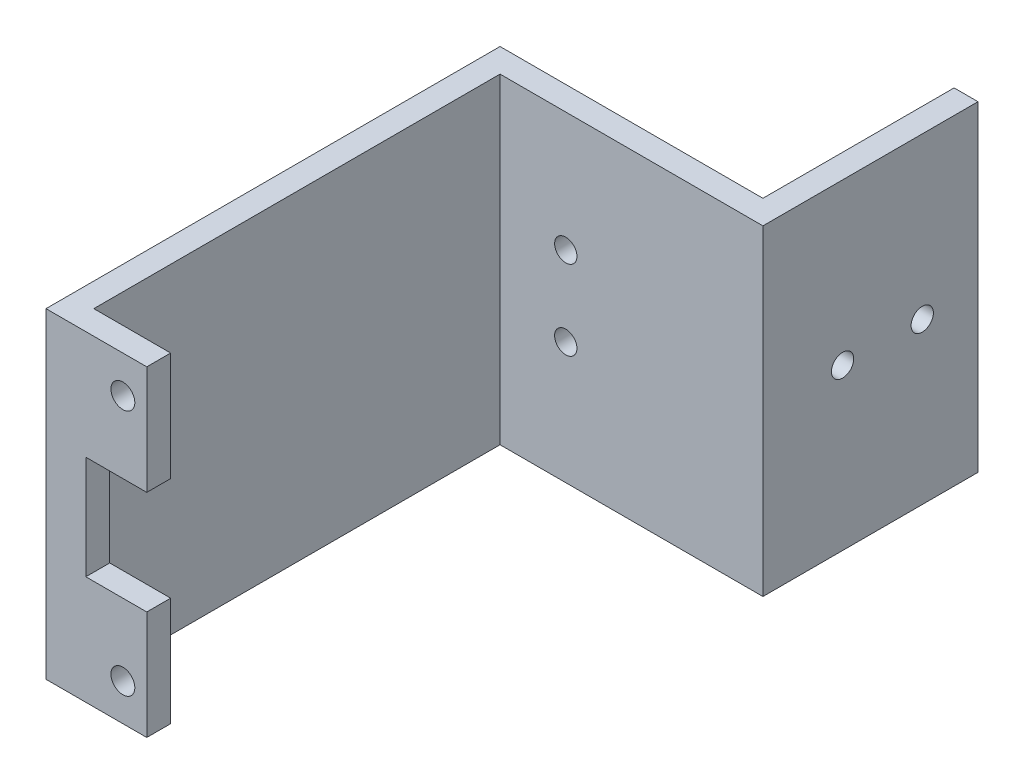
ISO-10303-21;
HEADER;
FILE_DESCRIPTION(('STEP AP214'),'2;1');
FILE_NAME('part.step','',(''),(''),'','','');
FILE_SCHEMA(('AUTOMOTIVE_DESIGN { 1 0 10303 214 1 1 1 1 }'));
ENDSEC;
DATA;
#1=APPLICATION_CONTEXT('core data for automotive mechanical design processes');
#2=APPLICATION_PROTOCOL_DEFINITION('international standard','automotive_design',2000,#1);
#3=PRODUCT_CONTEXT('',#1,'mechanical');
#4=PRODUCT('Part','Part','',(#3));
#5=PRODUCT_RELATED_PRODUCT_CATEGORY('part','',(#4));
#6=PRODUCT_DEFINITION_FORMATION('','',#4);
#7=PRODUCT_DEFINITION_CONTEXT('part definition',#1,'design');
#8=PRODUCT_DEFINITION('design','',#6,#7);
#9=PRODUCT_DEFINITION_SHAPE('','',#8);
#10=(LENGTH_UNIT() NAMED_UNIT(*) SI_UNIT(.MILLI.,.METRE.));
#11=(NAMED_UNIT(*) PLANE_ANGLE_UNIT() SI_UNIT($,.RADIAN.));
#12=(NAMED_UNIT(*) SI_UNIT($,.STERADIAN.) SOLID_ANGLE_UNIT());
#13=UNCERTAINTY_MEASURE_WITH_UNIT(LENGTH_MEASURE(1.E-05),#10,'distance_accuracy_value','');
#14=(GEOMETRIC_REPRESENTATION_CONTEXT(3) GLOBAL_UNCERTAINTY_ASSIGNED_CONTEXT((#13)) GLOBAL_UNIT_ASSIGNED_CONTEXT((#10,
#11,#12)) REPRESENTATION_CONTEXT('',''));
#15=CARTESIAN_POINT('',(0.,0.,0.));
#16=DIRECTION('',(0.,0.,1.));
#17=DIRECTION('',(1.,0.,0.));
#18=AXIS2_PLACEMENT_3D('',#15,#16,#17);
#19=CARTESIAN_POINT('',(0.,0.,0.));
#20=DIRECTION('',(0.,0.,1.));
#21=DIRECTION('',(1.,0.,0.));
#22=AXIS2_PLACEMENT_3D('',#19,#20,#21);
#23=PLANE('',#22);
#24=CARTESIAN_POINT('',(-31.8510270232931,15.5000000000036,0.));
#25=DIRECTION('',(0.,0.,1.));
#26=DIRECTION('',(1.,0.,0.));
#27=AXIS2_PLACEMENT_3D('',#24,#25,#26);
#28=CIRCLE('',#27,1.5);
#29=CARTESIAN_POINT('',(-30.3510270232931,15.5000000000036,0.));
#30=VERTEX_POINT('',#29);
#31=EDGE_CURVE('E165',#30,#30,#28,.T.);
#32=ORIENTED_EDGE('',*,*,#31,.T.);
#33=EDGE_LOOP('',(#32));
#34=FACE_BOUND('',#33,.T.);
#35=CARTESIAN_POINT('',(-31.8510270232925,-15.4999999999964,0.));
#36=DIRECTION('',(0.,0.,1.));
#37=DIRECTION('',(1.,0.,0.));
#38=AXIS2_PLACEMENT_3D('',#35,#36,#37);
#39=CIRCLE('',#38,1.5);
#40=CARTESIAN_POINT('',(-30.3510270232925,-15.4999999999964,0.));
#41=VERTEX_POINT('',#40);
#42=EDGE_CURVE('E162',#41,#41,#39,.T.);
#43=ORIENTED_EDGE('',*,*,#42,.T.);
#44=EDGE_LOOP('',(#43));
#45=FACE_BOUND('',#44,.T.);
#46=DIRECTION('',(0.,-1.,0.));
#47=VECTOR('',#46,1.);
#48=CARTESIAN_POINT('',(-38.5010270232934,0.,0.));
#49=LINE('',#48,#47);
#50=CARTESIAN_POINT('',(-38.5010270232934,20.1500000000041,0.));
#51=VERTEX_POINT('',#50);
#52=CARTESIAN_POINT('',(-38.5010270232934,-20.1499999999956,0.));
#53=VERTEX_POINT('',#52);
#54=EDGE_CURVE('E54',#51,#53,#49,.T.);
#55=ORIENTED_EDGE('',*,*,#54,.F.);
#56=DIRECTION('',(-1.,0.,0.));
#57=VECTOR('',#56,1.);
#58=CARTESIAN_POINT('',(0.,20.1500000000041,0.));
#59=LINE('',#58,#57);
#60=CARTESIAN_POINT('',(-28.851027023294,20.1500000000041,0.));
#61=VERTEX_POINT('',#60);
#62=EDGE_CURVE('E150',#61,#51,#59,.T.);
#63=ORIENTED_EDGE('',*,*,#62,.F.);
#64=DIRECTION('',(0.,-1.,0.));
#65=VECTOR('',#64,1.);
#66=CARTESIAN_POINT('',(-28.851027023294,0.,0.));
#67=LINE('',#66,#65);
#68=CARTESIAN_POINT('',(-28.851027023294,6.50000000001128,0.));
#69=VERTEX_POINT('',#68);
#70=EDGE_CURVE('E148',#61,#69,#67,.T.);
#71=ORIENTED_EDGE('',*,*,#70,.T.);
#72=DIRECTION('',(-1.,0.,0.));
#73=VECTOR('',#72,1.);
#74=CARTESIAN_POINT('',(0.,6.50000000001128,0.));
#75=LINE('',#74,#73);
#76=CARTESIAN_POINT('',(-36.5010270232933,6.50000000001127,0.));
#77=VERTEX_POINT('',#76);
#78=EDGE_CURVE('E159',#69,#77,#75,.T.);
#79=ORIENTED_EDGE('',*,*,#78,.T.);
#80=DIRECTION('',(0.,1.,0.));
#81=VECTOR('',#80,1.);
#82=CARTESIAN_POINT('',(-36.5010270232934,0.,0.));
#83=LINE('',#82,#81);
#84=CARTESIAN_POINT('',(-36.5010270232934,-6.49999999998873,0.));
#85=VERTEX_POINT('',#84);
#86=EDGE_CURVE('E157',#85,#77,#83,.T.);
#87=ORIENTED_EDGE('',*,*,#86,.F.);
#88=DIRECTION('',(-1.,0.,0.));
#89=VECTOR('',#88,1.);
#90=CARTESIAN_POINT('',(0.,-6.49999999998872,0.));
#91=LINE('',#90,#89);
#92=CARTESIAN_POINT('',(-28.8510270232926,-6.49999999998873,0.));
#93=VERTEX_POINT('',#92);
#94=EDGE_CURVE('E129',#93,#85,#91,.T.);
#95=ORIENTED_EDGE('',*,*,#94,.F.);
#96=DIRECTION('',(0.,1.,0.));
#97=VECTOR('',#96,1.);
#98=CARTESIAN_POINT('',(-28.8510270232926,-2.61792435697505E-13,0.));
#99=LINE('',#98,#97);
#100=CARTESIAN_POINT('',(-28.8510270232926,-20.1499999999956,0.));
#101=VERTEX_POINT('',#100);
#102=EDGE_CURVE('E154',#101,#93,#99,.T.);
#103=ORIENTED_EDGE('',*,*,#102,.F.);
#104=DIRECTION('',(-1.,0.,0.));
#105=VECTOR('',#104,1.);
#106=CARTESIAN_POINT('',(-2.31062401175741E-13,-20.1499999999959,0.));
#107=LINE('',#106,#105);
#108=EDGE_CURVE('E152',#101,#53,#107,.T.);
#109=ORIENTED_EDGE('',*,*,#108,.T.);
#110=EDGE_LOOP('',(#55,#63,#71,#79,#87,#95,#103,#109));
#111=FACE_BOUND('',#110,.T.);
#112=ADVANCED_FACE('F39',(#34,#45,#111),#23,.F.);
#113=CARTESIAN_POINT('',(-28.851027023294,0.,3.));
#114=DIRECTION('',(1.,0.,0.));
#115=DIRECTION('',(0.,0.,-1.));
#116=AXIS2_PLACEMENT_3D('',#113,#114,#115);
#117=PLANE('',#116);
#118=ORIENTED_EDGE('',*,*,#70,.F.);
#119=DIRECTION('',(0.,0.,-1.));
#120=VECTOR('',#119,1.);
#121=CARTESIAN_POINT('',(-28.851027023294,20.1500000000041,3.));
#122=LINE('',#121,#120);
#123=CARTESIAN_POINT('',(-28.851027023294,20.1500000000041,3.));
#124=VERTEX_POINT('',#123);
#125=EDGE_CURVE('E12',#124,#61,#122,.T.);
#126=ORIENTED_EDGE('',*,*,#125,.F.);
#127=DIRECTION('',(0.,-1.,0.));
#128=VECTOR('',#127,1.);
#129=CARTESIAN_POINT('',(-28.851027023294,0.,3.));
#130=LINE('',#129,#128);
#131=CARTESIAN_POINT('',(-28.851027023294,6.50000000001128,3.));
#132=VERTEX_POINT('',#131);
#133=EDGE_CURVE('E168',#124,#132,#130,.T.);
#134=ORIENTED_EDGE('',*,*,#133,.T.);
#135=DIRECTION('',(0.,0.,-1.));
#136=VECTOR('',#135,1.);
#137=CARTESIAN_POINT('',(-28.851027023294,6.50000000001128,3.));
#138=LINE('',#137,#136);
#139=EDGE_CURVE('E63',#132,#69,#138,.T.);
#140=ORIENTED_EDGE('',*,*,#139,.T.);
#141=EDGE_LOOP('',(#118,#126,#134,#140));
#142=FACE_BOUND('',#141,.T.);
#143=ADVANCED_FACE('F41',(#142),#117,.T.);
#144=CARTESIAN_POINT('',(0.,20.1500000000041,3.));
#145=DIRECTION('',(0.,-1.,0.));
#146=DIRECTION('',(0.,0.,-1.));
#147=AXIS2_PLACEMENT_3D('',#144,#145,#146);
#148=PLANE('',#147);
#149=ORIENTED_EDGE('',*,*,#62,.T.);
#150=DIRECTION('',(0.,0.,-1.));
#151=VECTOR('',#150,1.);
#152=CARTESIAN_POINT('',(-38.5010270232934,20.1500000000041,0.));
#153=LINE('',#152,#151);
#154=CARTESIAN_POINT('',(-38.5010270232934,20.1500000000041,-51.));
#155=VERTEX_POINT('',#154);
#156=EDGE_CURVE('E201',#51,#155,#153,.T.);
#157=ORIENTED_EDGE('',*,*,#156,.T.);
#158=DIRECTION('',(1.,0.,0.));
#159=VECTOR('',#158,1.);
#160=CARTESIAN_POINT('',(0.,20.1500000000041,-51.));
#161=LINE('',#160,#159);
#162=CARTESIAN_POINT('',(-5.50102702329343,20.1500000000041,-51.));
#163=VERTEX_POINT('',#162);
#164=EDGE_CURVE('E225',#155,#163,#161,.T.);
#165=ORIENTED_EDGE('',*,*,#164,.T.);
#166=DIRECTION('',(0.,0.,1.));
#167=VECTOR('',#166,1.);
#168=CARTESIAN_POINT('',(-5.50102702329343,20.1500000000041,-51.));
#169=LINE('',#168,#167);
#170=CARTESIAN_POINT('',(-5.50102702329343,20.1500000000041,-78.));
#171=VERTEX_POINT('',#170);
#172=EDGE_CURVE('E574',#171,#163,#169,.T.);
#173=ORIENTED_EDGE('',*,*,#172,.F.);
#174=DIRECTION('',(-1.,0.,0.));
#175=VECTOR('',#174,1.);
#176=CARTESIAN_POINT('',(-5.50102702329343,20.1500000000041,-78.));
#177=LINE('',#176,#175);
#178=CARTESIAN_POINT('',(-8.50102702329343,20.1500000000041,-78.));
#179=VERTEX_POINT('',#178);
#180=EDGE_CURVE('E577',#171,#179,#177,.T.);
#181=ORIENTED_EDGE('',*,*,#180,.T.);
#182=DIRECTION('',(0.,0.,1.));
#183=VECTOR('',#182,1.);
#184=CARTESIAN_POINT('',(-8.50102702329343,20.1500000000041,-51.));
#185=LINE('',#184,#183);
#186=CARTESIAN_POINT('',(-8.50102702329343,20.1500000000041,-54.));
#187=VERTEX_POINT('',#186);
#188=EDGE_CURVE('E207',#179,#187,#185,.T.);
#189=ORIENTED_EDGE('',*,*,#188,.T.);
#190=DIRECTION('',(1.,0.,0.));
#191=VECTOR('',#190,1.);
#192=CARTESIAN_POINT('',(0.,20.1500000000041,-54.));
#193=LINE('',#192,#191);
#194=CARTESIAN_POINT('',(-41.5010270232934,20.1500000000041,-54.));
#195=VERTEX_POINT('',#194);
#196=EDGE_CURVE('E198',#195,#187,#193,.T.);
#197=ORIENTED_EDGE('',*,*,#196,.F.);
#198=DIRECTION('',(0.,0.,-1.));
#199=VECTOR('',#198,1.);
#200=CARTESIAN_POINT('',(-41.5010270232934,20.1500000000041,3.));
#201=LINE('',#200,#199);
#202=CARTESIAN_POINT('',(-41.5010270232934,20.1500000000041,3.));
#203=VERTEX_POINT('',#202);
#204=EDGE_CURVE('E47',#203,#195,#201,.T.);
#205=ORIENTED_EDGE('',*,*,#204,.F.);
#206=DIRECTION('',(-1.,0.,0.));
#207=VECTOR('',#206,1.);
#208=CARTESIAN_POINT('',(0.,20.1500000000041,3.));
#209=LINE('',#208,#207);
#210=EDGE_CURVE('E241',#124,#203,#209,.T.);
#211=ORIENTED_EDGE('',*,*,#210,.F.);
#212=ORIENTED_EDGE('',*,*,#125,.T.);
#213=EDGE_LOOP('',(#149,#157,#165,#173,#181,#189,#197,#205,#211,#212));
#214=FACE_BOUND('',#213,.T.);
#215=ADVANCED_FACE('F204',(#214),#148,.F.);
#216=CARTESIAN_POINT('',(-41.5010270232934,0.,3.));
#217=DIRECTION('',(-1.,0.,0.));
#218=DIRECTION('',(0.,0.,1.));
#219=AXIS2_PLACEMENT_3D('',#216,#217,#218);
#220=PLANE('',#219);
#221=ORIENTED_EDGE('',*,*,#204,.T.);
#222=DIRECTION('',(0.,1.,0.));
#223=VECTOR('',#222,1.);
#224=CARTESIAN_POINT('',(-41.5010270232934,0.,-54.));
#225=LINE('',#224,#223);
#226=CARTESIAN_POINT('',(-41.5010270232934,-20.1499999999955,-54.));
#227=VERTEX_POINT('',#226);
#228=EDGE_CURVE('E185',#227,#195,#225,.T.);
#229=ORIENTED_EDGE('',*,*,#228,.F.);
#230=DIRECTION('',(0.,0.,-1.));
#231=VECTOR('',#230,1.);
#232=CARTESIAN_POINT('',(-41.5010270232934,-20.1499999999956,3.));
#233=LINE('',#232,#231);
#234=CARTESIAN_POINT('',(-41.5010270232934,-20.1499999999956,3.));
#235=VERTEX_POINT('',#234);
#236=EDGE_CURVE('E174',#235,#227,#233,.T.);
#237=ORIENTED_EDGE('',*,*,#236,.F.);
#238=DIRECTION('',(0.,1.,0.));
#239=VECTOR('',#238,1.);
#240=CARTESIAN_POINT('',(-41.5010270232934,0.,3.));
#241=LINE('',#240,#239);
#242=EDGE_CURVE('E188',#235,#203,#241,.T.);
#243=ORIENTED_EDGE('',*,*,#242,.T.);
#244=EDGE_LOOP('',(#221,#229,#237,#243));
#245=FACE_BOUND('',#244,.T.);
#246=ADVANCED_FACE('F183',(#245),#220,.T.);
#247=CARTESIAN_POINT('',(-2.31062401175741E-13,-20.1499999999959,3.));
#248=DIRECTION('',(0.,-1.,0.));
#249=DIRECTION('',(1.,0.,0.));
#250=AXIS2_PLACEMENT_3D('',#247,#248,#249);
#251=PLANE('',#250);
#252=ORIENTED_EDGE('',*,*,#108,.F.);
#253=DIRECTION('',(0.,0.,-1.));
#254=VECTOR('',#253,1.);
#255=CARTESIAN_POINT('',(-28.8510270232926,-20.1499999999956,3.));
#256=LINE('',#255,#254);
#257=CARTESIAN_POINT('',(-28.8510270232926,-20.1499999999956,3.));
#258=VERTEX_POINT('',#257);
#259=EDGE_CURVE('E172',#258,#101,#256,.T.);
#260=ORIENTED_EDGE('',*,*,#259,.F.);
#261=DIRECTION('',(-1.,0.,0.));
#262=VECTOR('',#261,1.);
#263=CARTESIAN_POINT('',(-2.31062401175741E-13,-20.1499999999959,3.));
#264=LINE('',#263,#262);
#265=EDGE_CURVE('E244',#258,#235,#264,.T.);
#266=ORIENTED_EDGE('',*,*,#265,.T.);
#267=ORIENTED_EDGE('',*,*,#236,.T.);
#268=DIRECTION('',(1.,0.,0.));
#269=VECTOR('',#268,1.);
#270=CARTESIAN_POINT('',(0.,-20.1499999999955,-54.));
#271=LINE('',#270,#269);
#272=CARTESIAN_POINT('',(-8.50102702329343,-20.1499999999955,-54.));
#273=VERTEX_POINT('',#272);
#274=EDGE_CURVE('E200',#227,#273,#271,.T.);
#275=ORIENTED_EDGE('',*,*,#274,.T.);
#276=DIRECTION('',(0.,0.,-1.));
#277=VECTOR('',#276,1.);
#278=CARTESIAN_POINT('',(-8.50102702329343,-20.1499999999955,-51.));
#279=LINE('',#278,#277);
#280=CARTESIAN_POINT('',(-8.50102702329343,-20.1499999999955,-78.));
#281=VERTEX_POINT('',#280);
#282=EDGE_CURVE('E562',#273,#281,#279,.T.);
#283=ORIENTED_EDGE('',*,*,#282,.T.);
#284=DIRECTION('',(-1.,0.,0.));
#285=VECTOR('',#284,1.);
#286=CARTESIAN_POINT('',(-5.50102702329343,-20.1499999999955,-78.));
#287=LINE('',#286,#285);
#288=CARTESIAN_POINT('',(-5.50102702329343,-20.1499999999955,-78.));
#289=VERTEX_POINT('',#288);
#290=EDGE_CURVE('E222',#289,#281,#287,.T.);
#291=ORIENTED_EDGE('',*,*,#290,.F.);
#292=DIRECTION('',(0.,0.,-1.));
#293=VECTOR('',#292,1.);
#294=CARTESIAN_POINT('',(-5.50102702329343,-20.1499999999955,-51.));
#295=LINE('',#294,#293);
#296=CARTESIAN_POINT('',(-5.50102702329343,-20.1499999999955,-51.));
#297=VERTEX_POINT('',#296);
#298=EDGE_CURVE('E568',#297,#289,#295,.T.);
#299=ORIENTED_EDGE('',*,*,#298,.F.);
#300=DIRECTION('',(1.,0.,0.));
#301=VECTOR('',#300,1.);
#302=CARTESIAN_POINT('',(0.,-20.1499999999955,-51.));
#303=LINE('',#302,#301);
#304=CARTESIAN_POINT('',(-38.5010270232934,-20.1499999999955,-51.));
#305=VERTEX_POINT('',#304);
#306=EDGE_CURVE('E228',#305,#297,#303,.T.);
#307=ORIENTED_EDGE('',*,*,#306,.F.);
#308=DIRECTION('',(0.,0.,-1.));
#309=VECTOR('',#308,1.);
#310=CARTESIAN_POINT('',(-38.5010270232934,-20.1499999999955,0.));
#311=LINE('',#310,#309);
#312=EDGE_CURVE('E236',#53,#305,#311,.T.);
#313=ORIENTED_EDGE('',*,*,#312,.F.);
#314=EDGE_LOOP('',(#252,#260,#266,#267,#275,#283,#291,#299,#307,#313));
#315=FACE_BOUND('',#314,.T.);
#316=ADVANCED_FACE('F248',(#315),#251,.T.);
#317=CARTESIAN_POINT('',(-28.8510270232926,-2.61792435697505E-13,3.));
#318=DIRECTION('',(-1.,0.,0.));
#319=DIRECTION('',(0.,-1.,0.));
#320=AXIS2_PLACEMENT_3D('',#317,#318,#319);
#321=PLANE('',#320);
#322=ORIENTED_EDGE('',*,*,#102,.T.);
#323=DIRECTION('',(0.,0.,-1.));
#324=VECTOR('',#323,1.);
#325=CARTESIAN_POINT('',(-28.8510270232926,-6.49999999998873,3.));
#326=LINE('',#325,#324);
#327=CARTESIAN_POINT('',(-28.8510270232926,-6.49999999998873,3.));
#328=VERTEX_POINT('',#327);
#329=EDGE_CURVE('E133',#328,#93,#326,.T.);
#330=ORIENTED_EDGE('',*,*,#329,.F.);
#331=DIRECTION('',(0.,1.,0.));
#332=VECTOR('',#331,1.);
#333=CARTESIAN_POINT('',(-28.8510270232926,-2.61792435697505E-13,3.));
#334=LINE('',#333,#332);
#335=EDGE_CURVE('E120',#258,#328,#334,.T.);
#336=ORIENTED_EDGE('',*,*,#335,.F.);
#337=ORIENTED_EDGE('',*,*,#259,.T.);
#338=EDGE_LOOP('',(#322,#330,#336,#337));
#339=FACE_BOUND('',#338,.T.);
#340=ADVANCED_FACE('F278',(#339),#321,.F.);
#341=CARTESIAN_POINT('',(0.,-6.49999999998872,3.));
#342=DIRECTION('',(0.,-1.,0.));
#343=DIRECTION('',(1.,0.,0.));
#344=AXIS2_PLACEMENT_3D('',#341,#342,#343);
#345=PLANE('',#344);
#346=ORIENTED_EDGE('',*,*,#94,.T.);
#347=DIRECTION('',(0.,0.,-1.));
#348=VECTOR('',#347,1.);
#349=CARTESIAN_POINT('',(-36.5010270232934,-6.49999999998873,3.));
#350=LINE('',#349,#348);
#351=CARTESIAN_POINT('',(-36.5010270232934,-6.49999999998873,3.));
#352=VERTEX_POINT('',#351);
#353=EDGE_CURVE('E126',#352,#85,#350,.T.);
#354=ORIENTED_EDGE('',*,*,#353,.F.);
#355=DIRECTION('',(-1.,0.,0.));
#356=VECTOR('',#355,1.);
#357=CARTESIAN_POINT('',(0.,-6.49999999998872,3.));
#358=LINE('',#357,#356);
#359=EDGE_CURVE('E109',#328,#352,#358,.T.);
#360=ORIENTED_EDGE('',*,*,#359,.F.);
#361=ORIENTED_EDGE('',*,*,#329,.T.);
#362=EDGE_LOOP('',(#346,#354,#360,#361));
#363=FACE_BOUND('',#362,.T.);
#364=ADVANCED_FACE('F127',(#363),#345,.F.);
#365=CARTESIAN_POINT('',(-36.5010270232934,0.,3.));
#366=DIRECTION('',(-1.,0.,0.));
#367=DIRECTION('',(0.,0.,1.));
#368=AXIS2_PLACEMENT_3D('',#365,#366,#367);
#369=PLANE('',#368);
#370=ORIENTED_EDGE('',*,*,#86,.T.);
#371=DIRECTION('',(0.,0.,-1.));
#372=VECTOR('',#371,1.);
#373=CARTESIAN_POINT('',(-36.5010270232933,6.50000000001127,3.));
#374=LINE('',#373,#372);
#375=CARTESIAN_POINT('',(-36.5010270232933,6.50000000001127,3.));
#376=VERTEX_POINT('',#375);
#377=EDGE_CURVE('E134',#376,#77,#374,.T.);
#378=ORIENTED_EDGE('',*,*,#377,.F.);
#379=DIRECTION('',(0.,1.,0.));
#380=VECTOR('',#379,1.);
#381=CARTESIAN_POINT('',(-36.5010270232934,0.,3.));
#382=LINE('',#381,#380);
#383=EDGE_CURVE('E116',#352,#376,#382,.T.);
#384=ORIENTED_EDGE('',*,*,#383,.F.);
#385=ORIENTED_EDGE('',*,*,#353,.T.);
#386=EDGE_LOOP('',(#370,#378,#384,#385));
#387=FACE_BOUND('',#386,.T.);
#388=ADVANCED_FACE('F136',(#387),#369,.F.);
#389=CARTESIAN_POINT('',(-31.8510270232925,-15.4999999999964,3.));
#390=DIRECTION('',(0.,0.,-1.));
#391=DIRECTION('',(-1.,0.,0.));
#392=AXIS2_PLACEMENT_3D('',#389,#390,#391);
#393=CYLINDRICAL_SURFACE('',#392,1.5);
#394=CARTESIAN_POINT('',(-31.8510270232925,-15.4999999999964,3.));
#395=DIRECTION('',(0.,0.,1.));
#396=DIRECTION('',(1.,0.,0.));
#397=AXIS2_PLACEMENT_3D('',#394,#395,#396);
#398=CIRCLE('',#397,1.5);
#399=CARTESIAN_POINT('',(-30.3510270232925,-15.4999999999964,3.));
#400=VERTEX_POINT('',#399);
#401=EDGE_CURVE('E139',#400,#400,#398,.T.);
#402=ORIENTED_EDGE('',*,*,#401,.T.);
#403=EDGE_LOOP('',(#402));
#404=FACE_BOUND('',#403,.T.);
#405=ORIENTED_EDGE('',*,*,#42,.F.);
#406=EDGE_LOOP('',(#405));
#407=FACE_BOUND('',#406,.T.);
#408=ADVANCED_FACE('F268',(#404,#407),#393,.F.);
#409=CARTESIAN_POINT('',(0.,6.50000000001128,3.));
#410=DIRECTION('',(0.,-1.,0.));
#411=DIRECTION('',(1.,0.,0.));
#412=AXIS2_PLACEMENT_3D('',#409,#410,#411);
#413=PLANE('',#412);
#414=ORIENTED_EDGE('',*,*,#78,.F.);
#415=ORIENTED_EDGE('',*,*,#139,.F.);
#416=DIRECTION('',(-1.,0.,0.));
#417=VECTOR('',#416,1.);
#418=CARTESIAN_POINT('',(0.,6.50000000001128,3.));
#419=LINE('',#418,#417);
#420=EDGE_CURVE('E137',#132,#376,#419,.T.);
#421=ORIENTED_EDGE('',*,*,#420,.T.);
#422=ORIENTED_EDGE('',*,*,#377,.T.);
#423=EDGE_LOOP('',(#414,#415,#421,#422));
#424=FACE_BOUND('',#423,.T.);
#425=ADVANCED_FACE('F266',(#424),#413,.T.);
#426=CARTESIAN_POINT('',(-31.8510270232931,15.5000000000036,3.));
#427=DIRECTION('',(0.,0.,-1.));
#428=DIRECTION('',(-1.,0.,0.));
#429=AXIS2_PLACEMENT_3D('',#426,#427,#428);
#430=CYLINDRICAL_SURFACE('',#429,1.5);
#431=CARTESIAN_POINT('',(-31.8510270232931,15.5000000000036,3.));
#432=DIRECTION('',(0.,0.,1.));
#433=DIRECTION('',(1.,0.,0.));
#434=AXIS2_PLACEMENT_3D('',#431,#432,#433);
#435=CIRCLE('',#434,1.5);
#436=CARTESIAN_POINT('',(-30.3510270232931,15.5000000000036,3.));
#437=VERTEX_POINT('',#436);
#438=EDGE_CURVE('E145',#437,#437,#435,.T.);
#439=ORIENTED_EDGE('',*,*,#438,.T.);
#440=EDGE_LOOP('',(#439));
#441=FACE_BOUND('',#440,.T.);
#442=ORIENTED_EDGE('',*,*,#31,.F.);
#443=EDGE_LOOP('',(#442));
#444=FACE_BOUND('',#443,.T.);
#445=ADVANCED_FACE('F263',(#441,#444),#430,.F.);
#446=CARTESIAN_POINT('',(0.,0.,3.));
#447=DIRECTION('',(0.,0.,1.));
#448=DIRECTION('',(1.,0.,0.));
#449=AXIS2_PLACEMENT_3D('',#446,#447,#448);
#450=PLANE('',#449);
#451=ORIENTED_EDGE('',*,*,#133,.F.);
#452=ORIENTED_EDGE('',*,*,#210,.T.);
#453=ORIENTED_EDGE('',*,*,#242,.F.);
#454=ORIENTED_EDGE('',*,*,#265,.F.);
#455=ORIENTED_EDGE('',*,*,#335,.T.);
#456=ORIENTED_EDGE('',*,*,#359,.T.);
#457=ORIENTED_EDGE('',*,*,#383,.T.);
#458=ORIENTED_EDGE('',*,*,#420,.F.);
#459=EDGE_LOOP('',(#451,#452,#453,#454,#455,#456,#457,#458));
#460=FACE_BOUND('',#459,.T.);
#461=ORIENTED_EDGE('',*,*,#401,.F.);
#462=EDGE_LOOP('',(#461));
#463=FACE_BOUND('',#462,.T.);
#464=ORIENTED_EDGE('',*,*,#438,.F.);
#465=EDGE_LOOP('',(#464));
#466=FACE_BOUND('',#465,.T.);
#467=ADVANCED_FACE('F112',(#460,#463,#466),#450,.T.);
#468=CARTESIAN_POINT('',(-38.5010270232934,0.,0.));
#469=DIRECTION('',(-1.,0.,0.));
#470=DIRECTION('',(0.,0.,1.));
#471=AXIS2_PLACEMENT_3D('',#468,#469,#470);
#472=PLANE('',#471);
#473=ORIENTED_EDGE('',*,*,#156,.F.);
#474=ORIENTED_EDGE('',*,*,#54,.T.);
#475=ORIENTED_EDGE('',*,*,#312,.T.);
#476=DIRECTION('',(0.,1.,0.));
#477=VECTOR('',#476,1.);
#478=CARTESIAN_POINT('',(-38.5010270232934,0.,-51.));
#479=LINE('',#478,#477);
#480=EDGE_CURVE('E233',#305,#155,#479,.T.);
#481=ORIENTED_EDGE('',*,*,#480,.T.);
#482=EDGE_LOOP('',(#473,#474,#475,#481));
#483=FACE_BOUND('',#482,.T.);
#484=ADVANCED_FACE('F325',(#483),#472,.F.);
#485=CARTESIAN_POINT('',(-30.2510270232934,5.15000000000414,-54.));
#486=DIRECTION('',(0.,0.,1.));
#487=DIRECTION('',(1.,0.,0.));
#488=AXIS2_PLACEMENT_3D('',#485,#486,#487);
#489=CYLINDRICAL_SURFACE('',#488,1.4);
#490=CARTESIAN_POINT('',(-30.2510270232934,5.15000000000414,-54.));
#491=DIRECTION('',(0.,0.,-1.));
#492=DIRECTION('',(-1.,0.,0.));
#493=AXIS2_PLACEMENT_3D('',#490,#491,#492);
#494=CIRCLE('',#493,1.4);
#495=CARTESIAN_POINT('',(-31.6510270232934,5.15000000000414,-54.));
#496=VERTEX_POINT('',#495);
#497=EDGE_CURVE('E209',#496,#496,#494,.T.);
#498=ORIENTED_EDGE('',*,*,#497,.T.);
#499=EDGE_LOOP('',(#498));
#500=FACE_BOUND('',#499,.T.);
#501=CARTESIAN_POINT('',(-30.2510270232934,5.15000000000414,-51.));
#502=DIRECTION('',(0.,0.,-1.));
#503=DIRECTION('',(-1.,0.,0.));
#504=AXIS2_PLACEMENT_3D('',#501,#502,#503);
#505=CIRCLE('',#504,1.4);
#506=CARTESIAN_POINT('',(-31.6510270232934,5.15000000000414,-51.));
#507=VERTEX_POINT('',#506);
#508=EDGE_CURVE('E221',#507,#507,#505,.T.);
#509=ORIENTED_EDGE('',*,*,#508,.F.);
#510=EDGE_LOOP('',(#509));
#511=FACE_BOUND('',#510,.T.);
#512=ADVANCED_FACE('F330',(#500,#511),#489,.F.);
#513=CARTESIAN_POINT('',(-30.2510270232934,-4.84999999999586,-54.));
#514=DIRECTION('',(0.,0.,1.));
#515=DIRECTION('',(1.,0.,0.));
#516=AXIS2_PLACEMENT_3D('',#513,#514,#515);
#517=CYLINDRICAL_SURFACE('',#516,1.4);
#518=CARTESIAN_POINT('',(-30.2510270232934,-4.84999999999586,-54.));
#519=DIRECTION('',(0.,0.,-1.));
#520=DIRECTION('',(-1.,0.,0.));
#521=AXIS2_PLACEMENT_3D('',#518,#519,#520);
#522=CIRCLE('',#521,1.4);
#523=CARTESIAN_POINT('',(-31.6510270232934,-4.84999999999586,-54.));
#524=VERTEX_POINT('',#523);
#525=EDGE_CURVE('E213',#524,#524,#522,.T.);
#526=ORIENTED_EDGE('',*,*,#525,.T.);
#527=EDGE_LOOP('',(#526));
#528=FACE_BOUND('',#527,.T.);
#529=CARTESIAN_POINT('',(-30.2510270232934,-4.84999999999586,-51.));
#530=DIRECTION('',(0.,0.,-1.));
#531=DIRECTION('',(-1.,0.,0.));
#532=AXIS2_PLACEMENT_3D('',#529,#530,#531);
#533=CIRCLE('',#532,1.4);
#534=CARTESIAN_POINT('',(-31.6510270232934,-4.84999999999586,-51.));
#535=VERTEX_POINT('',#534);
#536=EDGE_CURVE('E218',#535,#535,#533,.T.);
#537=ORIENTED_EDGE('',*,*,#536,.F.);
#538=EDGE_LOOP('',(#537));
#539=FACE_BOUND('',#538,.T.);
#540=ADVANCED_FACE('F337',(#528,#539),#517,.F.);
#541=CARTESIAN_POINT('',(0.,0.,-54.));
#542=DIRECTION('',(0.,0.,-1.));
#543=DIRECTION('',(-1.,0.,0.));
#544=AXIS2_PLACEMENT_3D('',#541,#542,#543);
#545=PLANE('',#544);
#546=ORIENTED_EDGE('',*,*,#525,.F.);
#547=EDGE_LOOP('',(#546));
#548=FACE_BOUND('',#547,.T.);
#549=ORIENTED_EDGE('',*,*,#497,.F.);
#550=EDGE_LOOP('',(#549));
#551=FACE_BOUND('',#550,.T.);
#552=ORIENTED_EDGE('',*,*,#196,.T.);
#553=DIRECTION('',(0.,-1.,0.));
#554=VECTOR('',#553,1.);
#555=CARTESIAN_POINT('',(-8.50102702329343,0.,-54.));
#556=LINE('',#555,#554);
#557=EDGE_CURVE('E208',#187,#273,#556,.T.);
#558=ORIENTED_EDGE('',*,*,#557,.T.);
#559=ORIENTED_EDGE('',*,*,#274,.F.);
#560=ORIENTED_EDGE('',*,*,#228,.T.);
#561=EDGE_LOOP('',(#552,#558,#559,#560));
#562=FACE_BOUND('',#561,.T.);
#563=ADVANCED_FACE('F195',(#548,#551,#562),#545,.T.);
#564=CARTESIAN_POINT('',(0.,0.,-51.));
#565=DIRECTION('',(0.,0.,-1.));
#566=DIRECTION('',(-1.,0.,0.));
#567=AXIS2_PLACEMENT_3D('',#564,#565,#566);
#568=PLANE('',#567);
#569=ORIENTED_EDGE('',*,*,#480,.F.);
#570=ORIENTED_EDGE('',*,*,#306,.T.);
#571=DIRECTION('',(0.,-1.,0.));
#572=VECTOR('',#571,1.);
#573=CARTESIAN_POINT('',(-5.50102702329343,-20.1499999999955,-51.));
#574=LINE('',#573,#572);
#575=EDGE_CURVE('E565',#163,#297,#574,.T.);
#576=ORIENTED_EDGE('',*,*,#575,.F.);
#577=ORIENTED_EDGE('',*,*,#164,.F.);
#578=EDGE_LOOP('',(#569,#570,#576,#577));
#579=FACE_BOUND('',#578,.T.);
#580=ORIENTED_EDGE('',*,*,#536,.T.);
#581=EDGE_LOOP('',(#580));
#582=FACE_BOUND('',#581,.T.);
#583=ORIENTED_EDGE('',*,*,#508,.T.);
#584=EDGE_LOOP('',(#583));
#585=FACE_BOUND('',#584,.T.);
#586=ADVANCED_FACE('F351',(#579,#582,#585),#568,.F.);
#587=CARTESIAN_POINT('',(-8.50102702329343,0.,0.));
#588=DIRECTION('',(-1.,0.,0.));
#589=DIRECTION('',(0.,0.,1.));
#590=AXIS2_PLACEMENT_3D('',#587,#588,#589);
#591=PLANE('',#590);
#592=CARTESIAN_POINT('',(-8.50102702329343,-1.18564957902496E-12,-60.9999999999994));
#593=DIRECTION('',(1.,0.,0.));
#594=DIRECTION('',(0.,0.,-1.));
#595=AXIS2_PLACEMENT_3D('',#592,#593,#594);
#596=CIRCLE('',#595,1.4);
#597=CARTESIAN_POINT('',(-8.50102702329343,-1.18564957902496E-12,-62.3999999999994));
#598=VERTEX_POINT('',#597);
#599=EDGE_CURVE('E554',#598,#598,#596,.T.);
#600=ORIENTED_EDGE('',*,*,#599,.T.);
#601=EDGE_LOOP('',(#600));
#602=FACE_BOUND('',#601,.T.);
#603=CARTESIAN_POINT('',(-8.50102702329343,-1.20281465365263E-12,-70.9999999999994));
#604=DIRECTION('',(1.,0.,0.));
#605=DIRECTION('',(0.,0.,-1.));
#606=AXIS2_PLACEMENT_3D('',#603,#604,#605);
#607=CIRCLE('',#606,1.4);
#608=CARTESIAN_POINT('',(-8.50102702329343,-1.20281465365263E-12,-72.3999999999994));
#609=VERTEX_POINT('',#608);
#610=EDGE_CURVE('E556',#609,#609,#607,.T.);
#611=ORIENTED_EDGE('',*,*,#610,.T.);
#612=EDGE_LOOP('',(#611));
#613=FACE_BOUND('',#612,.T.);
#614=ORIENTED_EDGE('',*,*,#557,.F.);
#615=ORIENTED_EDGE('',*,*,#188,.F.);
#616=DIRECTION('',(0.,1.,0.));
#617=VECTOR('',#616,1.);
#618=CARTESIAN_POINT('',(-8.50102702329343,-20.1499999999955,-78.));
#619=LINE('',#618,#617);
#620=EDGE_CURVE('E580',#281,#179,#619,.T.);
#621=ORIENTED_EDGE('',*,*,#620,.F.);
#622=ORIENTED_EDGE('',*,*,#282,.F.);
#623=EDGE_LOOP('',(#614,#615,#621,#622));
#624=FACE_BOUND('',#623,.T.);
#625=ADVANCED_FACE('F359',(#602,#613,#624),#591,.T.);
#626=CARTESIAN_POINT('',(-5.50102702329343,0.,0.));
#627=DIRECTION('',(-1.,0.,0.));
#628=DIRECTION('',(0.,0.,1.));
#629=AXIS2_PLACEMENT_3D('',#626,#627,#628);
#630=PLANE('',#629);
#631=ORIENTED_EDGE('',*,*,#575,.T.);
#632=ORIENTED_EDGE('',*,*,#298,.T.);
#633=DIRECTION('',(0.,1.,0.));
#634=VECTOR('',#633,1.);
#635=CARTESIAN_POINT('',(-5.50102702329343,-20.1499999999955,-78.));
#636=LINE('',#635,#634);
#637=EDGE_CURVE('E571',#289,#171,#636,.T.);
#638=ORIENTED_EDGE('',*,*,#637,.T.);
#639=ORIENTED_EDGE('',*,*,#172,.T.);
#640=EDGE_LOOP('',(#631,#632,#638,#639));
#641=FACE_BOUND('',#640,.T.);
#642=CARTESIAN_POINT('',(-5.50102702329343,-1.20281465365263E-12,-70.9999999999994));
#643=DIRECTION('',(1.,0.,0.));
#644=DIRECTION('',(0.,0.,-1.));
#645=AXIS2_PLACEMENT_3D('',#642,#643,#644);
#646=CIRCLE('',#645,1.4);
#647=CARTESIAN_POINT('',(-5.50102702329343,-1.20281465365263E-12,-72.3999999999994));
#648=VERTEX_POINT('',#647);
#649=EDGE_CURVE('E559',#648,#648,#646,.T.);
#650=ORIENTED_EDGE('',*,*,#649,.F.);
#651=EDGE_LOOP('',(#650));
#652=FACE_BOUND('',#651,.T.);
#653=CARTESIAN_POINT('',(-5.50102702329343,-1.18564957902496E-12,-60.9999999999994));
#654=DIRECTION('',(1.,0.,0.));
#655=DIRECTION('',(0.,0.,-1.));
#656=AXIS2_PLACEMENT_3D('',#653,#654,#655);
#657=CIRCLE('',#656,1.4);
#658=CARTESIAN_POINT('',(-5.50102702329343,-1.18564957902496E-12,-62.3999999999994));
#659=VERTEX_POINT('',#658);
#660=EDGE_CURVE('E551',#659,#659,#657,.T.);
#661=ORIENTED_EDGE('',*,*,#660,.F.);
#662=EDGE_LOOP('',(#661));
#663=FACE_BOUND('',#662,.T.);
#664=ADVANCED_FACE('F367',(#641,#652,#663),#630,.F.);
#665=CARTESIAN_POINT('',(-5.50102702329343,-20.1499999999955,-78.));
#666=DIRECTION('',(0.,0.,1.));
#667=DIRECTION('',(1.,0.,0.));
#668=AXIS2_PLACEMENT_3D('',#665,#666,#667);
#669=PLANE('',#668);
#670=ORIENTED_EDGE('',*,*,#620,.T.);
#671=ORIENTED_EDGE('',*,*,#180,.F.);
#672=ORIENTED_EDGE('',*,*,#637,.F.);
#673=ORIENTED_EDGE('',*,*,#290,.T.);
#674=EDGE_LOOP('',(#670,#671,#672,#673));
#675=FACE_BOUND('',#674,.T.);
#676=ADVANCED_FACE('F375',(#675),#669,.F.);
#677=CARTESIAN_POINT('',(-5.50102702329343,-1.20281465365263E-12,-70.9999999999994));
#678=DIRECTION('',(-1.,0.,0.));
#679=DIRECTION('',(0.,0.,1.));
#680=AXIS2_PLACEMENT_3D('',#677,#678,#679);
#681=CYLINDRICAL_SURFACE('',#680,1.4);
#682=ORIENTED_EDGE('',*,*,#649,.T.);
#683=EDGE_LOOP('',(#682));
#684=FACE_BOUND('',#683,.T.);
#685=ORIENTED_EDGE('',*,*,#610,.F.);
#686=EDGE_LOOP('',(#685));
#687=FACE_BOUND('',#686,.T.);
#688=ADVANCED_FACE('F383',(#684,#687),#681,.F.);
#689=CARTESIAN_POINT('',(-5.50102702329343,-1.18564957902496E-12,-60.9999999999994));
#690=DIRECTION('',(-1.,0.,0.));
#691=DIRECTION('',(0.,0.,1.));
#692=AXIS2_PLACEMENT_3D('',#689,#690,#691);
#693=CYLINDRICAL_SURFACE('',#692,1.4);
#694=ORIENTED_EDGE('',*,*,#660,.T.);
#695=EDGE_LOOP('',(#694));
#696=FACE_BOUND('',#695,.T.);
#697=ORIENTED_EDGE('',*,*,#599,.F.);
#698=EDGE_LOOP('',(#697));
#699=FACE_BOUND('',#698,.T.);
#700=ADVANCED_FACE('F391',(#696,#699),#693,.F.);
#701=CLOSED_SHELL('',(#112,#143,#215,#246,#316,#340,#364,#388,#408,#425,#445,#467,#484,#512,
#540,#563,#586,#625,#664,#676,#688,#700));
#702=MANIFOLD_SOLID_BREP('B2',#701);
#703=ADVANCED_BREP_SHAPE_REPRESENTATION('',(#18,#702),#14);
#704=SHAPE_DEFINITION_REPRESENTATION(#9,#703);
ENDSEC;
END-ISO-10303-21;
